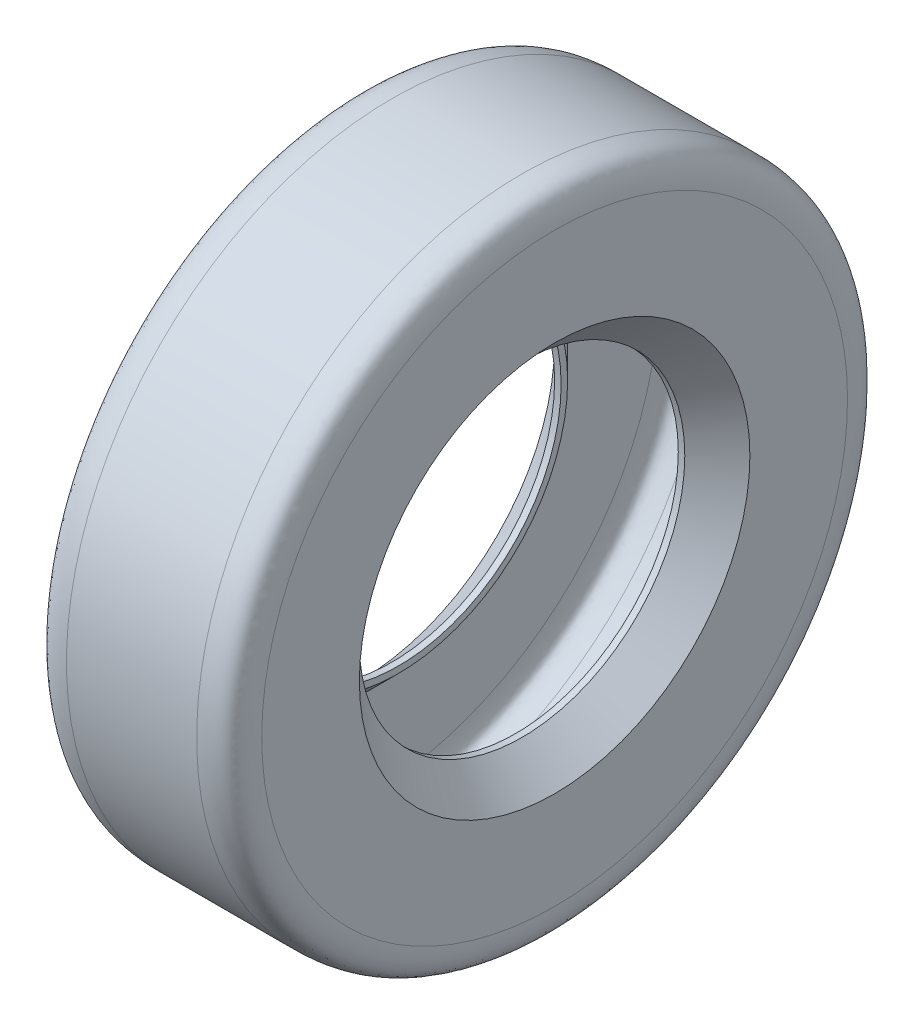
ISO-10303-21;
HEADER;
FILE_DESCRIPTION(('STEP AP214'),'2;1');
FILE_NAME('part.step','',(''),(''),'','','');
FILE_SCHEMA(('AUTOMOTIVE_DESIGN { 1 0 10303 214 1 1 1 1 }'));
ENDSEC;
DATA;
#1=APPLICATION_CONTEXT('core data for automotive mechanical design processes');
#2=APPLICATION_PROTOCOL_DEFINITION('international standard','automotive_design',2000,#1);
#3=PRODUCT_CONTEXT('',#1,'mechanical');
#4=PRODUCT('Part','Part','',(#3));
#5=PRODUCT_RELATED_PRODUCT_CATEGORY('part','',(#4));
#6=PRODUCT_DEFINITION_FORMATION('','',#4);
#7=PRODUCT_DEFINITION_CONTEXT('part definition',#1,'design');
#8=PRODUCT_DEFINITION('design','',#6,#7);
#9=PRODUCT_DEFINITION_SHAPE('','',#8);
#10=(LENGTH_UNIT() NAMED_UNIT(*) SI_UNIT(.MILLI.,.METRE.));
#11=(NAMED_UNIT(*) PLANE_ANGLE_UNIT() SI_UNIT($,.RADIAN.));
#12=(NAMED_UNIT(*) SI_UNIT($,.STERADIAN.) SOLID_ANGLE_UNIT());
#13=UNCERTAINTY_MEASURE_WITH_UNIT(LENGTH_MEASURE(1.E-05),#10,'distance_accuracy_value','');
#14=(GEOMETRIC_REPRESENTATION_CONTEXT(3) GLOBAL_UNCERTAINTY_ASSIGNED_CONTEXT((#13)) GLOBAL_UNIT_ASSIGNED_CONTEXT((#10,
#11,#12)) REPRESENTATION_CONTEXT('',''));
#15=CARTESIAN_POINT('',(0.,0.,0.));
#16=DIRECTION('',(0.,0.,1.));
#17=DIRECTION('',(1.,0.,0.));
#18=AXIS2_PLACEMENT_3D('',#15,#16,#17);
#19=CARTESIAN_POINT('',(0.,0.,0.));
#20=DIRECTION('',(1.,0.,0.));
#21=DIRECTION('',(0.,0.,-1.));
#22=AXIS2_PLACEMENT_3D('',#19,#20,#21);
#23=CYLINDRICAL_SURFACE('',#22,63.5);
#24=CARTESIAN_POINT('',(25.4,0.,0.));
#25=DIRECTION('',(1.,0.,0.));
#26=DIRECTION('',(0.,0.,-1.));
#27=AXIS2_PLACEMENT_3D('',#24,#25,#26);
#28=CIRCLE('',#27,63.5);
#29=CARTESIAN_POINT('',(25.4,0.,-63.5));
#30=VERTEX_POINT('',#29);
#31=EDGE_CURVE('E89',#30,#30,#28,.T.);
#32=ORIENTED_EDGE('',*,*,#31,.T.);
#33=EDGE_LOOP('',(#32));
#34=FACE_BOUND('',#33,.T.);
#35=CARTESIAN_POINT('',(22.86,0.,0.));
#36=DIRECTION('',(1.,0.,0.));
#37=DIRECTION('',(0.,0.,-1.));
#38=AXIS2_PLACEMENT_3D('',#35,#36,#37);
#39=CIRCLE('',#38,63.5);
#40=CARTESIAN_POINT('',(22.86,0.,-63.5));
#41=VERTEX_POINT('',#40);
#42=EDGE_CURVE('E10',#41,#41,#39,.T.);
#43=ORIENTED_EDGE('',*,*,#42,.F.);
#44=EDGE_LOOP('',(#43));
#45=FACE_BOUND('',#44,.T.);
#46=ADVANCED_FACE('F31',(#34,#45),#23,.F.);
#47=CARTESIAN_POINT('',(22.86,66.04,0.));
#48=DIRECTION('',(-1.,0.,0.));
#49=DIRECTION('',(0.,0.,1.));
#50=AXIS2_PLACEMENT_3D('',#47,#48,#49);
#51=PLANE('',#50);
#52=ORIENTED_EDGE('',*,*,#42,.T.);
#53=EDGE_LOOP('',(#52));
#54=FACE_BOUND('',#53,.T.);
#55=CARTESIAN_POINT('',(22.86,0.,0.));
#56=DIRECTION('',(1.,0.,0.));
#57=DIRECTION('',(0.,0.,-1.));
#58=AXIS2_PLACEMENT_3D('',#55,#56,#57);
#59=CIRCLE('',#58,66.04);
#60=CARTESIAN_POINT('',(22.86,0.,-66.04));
#61=VERTEX_POINT('',#60);
#62=EDGE_CURVE('E37',#61,#61,#59,.T.);
#63=ORIENTED_EDGE('',*,*,#62,.F.);
#64=EDGE_LOOP('',(#63));
#65=FACE_BOUND('',#64,.T.);
#66=ADVANCED_FACE('F117',(#54,#65),#51,.T.);
#67=CARTESIAN_POINT('',(35.56,0.,0.));
#68=DIRECTION('',(1.,0.,0.));
#69=DIRECTION('',(0.,0.,-1.));
#70=AXIS2_PLACEMENT_3D('',#67,#68,#69);
#71=CONICAL_SURFACE('',#70,78.74,0.785398163397449);
#72=ORIENTED_EDGE('',*,*,#62,.T.);
#73=EDGE_LOOP('',(#72));
#74=FACE_BOUND('',#73,.T.);
#75=CARTESIAN_POINT('',(35.56,0.,0.));
#76=DIRECTION('',(1.,0.,0.));
#77=DIRECTION('',(0.,0.,-1.));
#78=AXIS2_PLACEMENT_3D('',#75,#76,#77);
#79=CIRCLE('',#78,78.74);
#80=CARTESIAN_POINT('',(35.56,0.,-78.74));
#81=VERTEX_POINT('',#80);
#82=EDGE_CURVE('E41',#81,#81,#79,.T.);
#83=ORIENTED_EDGE('',*,*,#82,.F.);
#84=EDGE_LOOP('',(#83));
#85=FACE_BOUND('',#84,.T.);
#86=ADVANCED_FACE('F114',(#74,#85),#71,.T.);
#87=CARTESIAN_POINT('',(35.56,78.74,0.));
#88=DIRECTION('',(-1.,0.,0.));
#89=DIRECTION('',(0.,0.,1.));
#90=AXIS2_PLACEMENT_3D('',#87,#88,#89);
#91=PLANE('',#90);
#92=ORIENTED_EDGE('',*,*,#82,.T.);
#93=EDGE_LOOP('',(#92));
#94=FACE_BOUND('',#93,.T.);
#95=CARTESIAN_POINT('',(35.56,0.,0.));
#96=DIRECTION('',(1.,0.,0.));
#97=DIRECTION('',(0.,0.,-1.));
#98=AXIS2_PLACEMENT_3D('',#95,#96,#97);
#99=CIRCLE('',#98,114.3);
#100=CARTESIAN_POINT('',(35.56,0.,-114.3));
#101=VERTEX_POINT('',#100);
#102=EDGE_CURVE('E45',#101,#101,#99,.T.);
#103=ORIENTED_EDGE('',*,*,#102,.F.);
#104=EDGE_LOOP('',(#103));
#105=FACE_BOUND('',#104,.T.);
#106=ADVANCED_FACE('F109',(#94,#105),#91,.T.);
#107=CARTESIAN_POINT('',(25.4,124.46,0.));
#108=CARTESIAN_POINT('',(25.805832113396,124.46,0.));
#109=CARTESIAN_POINT('',(26.605403528514,124.460196460358,0.));
#110=CARTESIAN_POINT('',(28.3012248589449,124.423710763719,0.));
#111=CARTESIAN_POINT('',(30.4170550067174,124.242459368176,0.));
#112=CARTESIAN_POINT('',(32.2004204589752,123.750562190293,0.));
#113=CARTESIAN_POINT('',(33.2340314195877,123.186604386032,0.));
#114=CARTESIAN_POINT('',(33.8075713292461,122.705830521384,0.));
#115=CARTESIAN_POINT('',(34.2493325661398,122.117984468043,0.));
#116=CARTESIAN_POINT('',(34.691360923176,121.193385658606,0.));
#117=CARTESIAN_POINT('',(35.0400017191156,120.054632817678,0.));
#118=CARTESIAN_POINT('',(35.2911342849393,118.787688940268,0.));
#119=CARTESIAN_POINT('',(35.4485013209214,117.490904625784,0.));
#120=CARTESIAN_POINT('',(35.5304238452179,116.249768154165,0.));
#121=CARTESIAN_POINT('',(35.5545290754917,115.335705853149,0.));
#122=CARTESIAN_POINT('',(35.5598481338527,114.699197969848,0.));
#123=CARTESIAN_POINT('',(35.56,114.437804616846,0.));
#124=CARTESIAN_POINT('',(35.56,114.3,0.));
#125=B_SPLINE_CURVE_WITH_KNOTS('',3,(#107,#108,#109,#110,#111,#112,#113,#114,#115,#116,#117,
#118,#119,#120,#121,#122,#123,#124),.UNSPECIFIED.,.F.,.F.,(4,1,1,1,1,1,1,1,1,1,1,1,1,1,1,4),(0.,
0.0625,0.125,0.25,0.375,0.4375,0.5,0.5625,0.625,0.6875,0.75,0.8125,0.875,0.9375,0.96875,1.),.UNSPECIFIED.);
#126=CARTESIAN_POINT('',(0.,0.,0.));
#127=DIRECTION('',(1.,0.,0.));
#128=AXIS1_PLACEMENT('',#126,#127);
#129=SURFACE_OF_REVOLUTION('',#125,#128);
#130=ORIENTED_EDGE('',*,*,#102,.T.);
#131=EDGE_LOOP('',(#130));
#132=FACE_BOUND('',#131,.T.);
#133=CARTESIAN_POINT('',(25.4,0.,0.));
#134=DIRECTION('',(1.,0.,0.));
#135=DIRECTION('',(0.,0.,-1.));
#136=AXIS2_PLACEMENT_3D('',#133,#134,#135);
#137=CIRCLE('',#136,124.46);
#138=CARTESIAN_POINT('',(25.4,0.,-124.46));
#139=VERTEX_POINT('',#138);
#140=EDGE_CURVE('E50',#139,#139,#137,.T.);
#141=ORIENTED_EDGE('',*,*,#140,.F.);
#142=EDGE_LOOP('',(#141));
#143=FACE_BOUND('',#142,.T.);
#144=ADVANCED_FACE('F104',(#132,#143),#129,.F.);
#145=CARTESIAN_POINT('',(0.,0.,0.));
#146=DIRECTION('',(1.,0.,0.));
#147=DIRECTION('',(0.,0.,-1.));
#148=AXIS2_PLACEMENT_3D('',#145,#146,#147);
#149=CYLINDRICAL_SURFACE('',#148,124.46);
#150=ORIENTED_EDGE('',*,*,#140,.T.);
#151=EDGE_LOOP('',(#150));
#152=FACE_BOUND('',#151,.T.);
#153=CARTESIAN_POINT('',(-25.4,0.,0.));
#154=DIRECTION('',(1.,0.,0.));
#155=DIRECTION('',(0.,0.,-1.));
#156=AXIS2_PLACEMENT_3D('',#153,#154,#155);
#157=CIRCLE('',#156,124.46);
#158=CARTESIAN_POINT('',(-25.4,0.,-124.46));
#159=VERTEX_POINT('',#158);
#160=EDGE_CURVE('E53',#159,#159,#157,.T.);
#161=ORIENTED_EDGE('',*,*,#160,.F.);
#162=EDGE_LOOP('',(#161));
#163=FACE_BOUND('',#162,.T.);
#164=ADVANCED_FACE('F108',(#152,#163),#149,.F.);
#165=CARTESIAN_POINT('',(-35.56,114.3,0.));
#166=CARTESIAN_POINT('',(-35.56,114.437804616846,0.));
#167=CARTESIAN_POINT('',(-35.5598481338527,114.699197969848,0.));
#168=CARTESIAN_POINT('',(-35.5545290754917,115.335705853149,0.));
#169=CARTESIAN_POINT('',(-35.5304238452179,116.249768154165,0.));
#170=CARTESIAN_POINT('',(-35.4485013209214,117.490904625784,0.));
#171=CARTESIAN_POINT('',(-35.2911342849393,118.787688940268,0.));
#172=CARTESIAN_POINT('',(-35.0400017191156,120.054632817678,0.));
#173=CARTESIAN_POINT('',(-34.691360923176,121.193385658606,0.));
#174=CARTESIAN_POINT('',(-34.2493325661398,122.117984468043,0.));
#175=CARTESIAN_POINT('',(-33.8075713292461,122.705830521384,0.));
#176=CARTESIAN_POINT('',(-33.2340314195877,123.186604386032,0.));
#177=CARTESIAN_POINT('',(-32.2004204589752,123.750562190293,0.));
#178=CARTESIAN_POINT('',(-30.4170550067174,124.242459368176,0.));
#179=CARTESIAN_POINT('',(-28.3012248589449,124.423710763719,0.));
#180=CARTESIAN_POINT('',(-26.605403528514,124.460196460358,0.));
#181=CARTESIAN_POINT('',(-25.805832113396,124.46,0.));
#182=CARTESIAN_POINT('',(-25.4,124.46,0.));
#183=B_SPLINE_CURVE_WITH_KNOTS('',3,(#165,#166,#167,#168,#169,#170,#171,#172,#173,#174,#175,
#176,#177,#178,#179,#180,#181,#182),.UNSPECIFIED.,.F.,.F.,(4,1,1,1,1,1,1,1,1,1,1,1,1,1,1,4),(0.,
0.03125,0.0625,0.125,0.1875,0.25,0.3125,0.375,0.4375,0.5,0.5625,0.625,0.75,0.875,0.9375,1.),.UNSPECIFIED.);
#184=CARTESIAN_POINT('',(0.,0.,0.));
#185=DIRECTION('',(1.,0.,0.));
#186=AXIS1_PLACEMENT('',#184,#185);
#187=SURFACE_OF_REVOLUTION('',#183,#186);
#188=ORIENTED_EDGE('',*,*,#160,.T.);
#189=EDGE_LOOP('',(#188));
#190=FACE_BOUND('',#189,.T.);
#191=CARTESIAN_POINT('',(-35.56,0.,0.));
#192=DIRECTION('',(1.,0.,0.));
#193=DIRECTION('',(0.,0.,-1.));
#194=AXIS2_PLACEMENT_3D('',#191,#192,#193);
#195=CIRCLE('',#194,114.3);
#196=CARTESIAN_POINT('',(-35.56,0.,-114.3));
#197=VERTEX_POINT('',#196);
#198=EDGE_CURVE('E56',#197,#197,#195,.T.);
#199=ORIENTED_EDGE('',*,*,#198,.F.);
#200=EDGE_LOOP('',(#199));
#201=FACE_BOUND('',#200,.T.);
#202=ADVANCED_FACE('F185',(#190,#201),#187,.F.);
#203=CARTESIAN_POINT('',(-35.56,78.74,0.));
#204=DIRECTION('',(1.,0.,0.));
#205=DIRECTION('',(0.,0.,-1.));
#206=AXIS2_PLACEMENT_3D('',#203,#204,#205);
#207=PLANE('',#206);
#208=ORIENTED_EDGE('',*,*,#198,.T.);
#209=EDGE_LOOP('',(#208));
#210=FACE_BOUND('',#209,.T.);
#211=CARTESIAN_POINT('',(-35.56,0.,0.));
#212=DIRECTION('',(1.,0.,0.));
#213=DIRECTION('',(0.,0.,-1.));
#214=AXIS2_PLACEMENT_3D('',#211,#212,#213);
#215=CIRCLE('',#214,78.74);
#216=CARTESIAN_POINT('',(-35.56,0.,-78.74));
#217=VERTEX_POINT('',#216);
#218=EDGE_CURVE('E59',#217,#217,#215,.T.);
#219=ORIENTED_EDGE('',*,*,#218,.F.);
#220=EDGE_LOOP('',(#219));
#221=FACE_BOUND('',#220,.T.);
#222=ADVANCED_FACE('F182',(#210,#221),#207,.T.);
#223=CARTESIAN_POINT('',(-22.86,0.,0.));
#224=DIRECTION('',(-1.,0.,0.));
#225=DIRECTION('',(0.,0.,1.));
#226=AXIS2_PLACEMENT_3D('',#223,#224,#225);
#227=CONICAL_SURFACE('',#226,66.04,0.785398163397449);
#228=ORIENTED_EDGE('',*,*,#218,.T.);
#229=EDGE_LOOP('',(#228));
#230=FACE_BOUND('',#229,.T.);
#231=CARTESIAN_POINT('',(-22.86,0.,0.));
#232=DIRECTION('',(1.,0.,0.));
#233=DIRECTION('',(0.,0.,-1.));
#234=AXIS2_PLACEMENT_3D('',#231,#232,#233);
#235=CIRCLE('',#234,66.04);
#236=CARTESIAN_POINT('',(-22.86,0.,-66.04));
#237=VERTEX_POINT('',#236);
#238=EDGE_CURVE('E62',#237,#237,#235,.T.);
#239=ORIENTED_EDGE('',*,*,#238,.F.);
#240=EDGE_LOOP('',(#239));
#241=FACE_BOUND('',#240,.T.);
#242=ADVANCED_FACE('F178',(#230,#241),#227,.T.);
#243=CARTESIAN_POINT('',(-22.86,66.04,0.));
#244=DIRECTION('',(1.,0.,0.));
#245=DIRECTION('',(0.,0.,-1.));
#246=AXIS2_PLACEMENT_3D('',#243,#244,#245);
#247=PLANE('',#246);
#248=ORIENTED_EDGE('',*,*,#238,.T.);
#249=EDGE_LOOP('',(#248));
#250=FACE_BOUND('',#249,.T.);
#251=CARTESIAN_POINT('',(-22.86,0.,0.));
#252=DIRECTION('',(1.,0.,0.));
#253=DIRECTION('',(0.,0.,-1.));
#254=AXIS2_PLACEMENT_3D('',#251,#252,#253);
#255=CIRCLE('',#254,63.5);
#256=CARTESIAN_POINT('',(-22.86,0.,-63.5));
#257=VERTEX_POINT('',#256);
#258=EDGE_CURVE('E65',#257,#257,#255,.T.);
#259=ORIENTED_EDGE('',*,*,#258,.F.);
#260=EDGE_LOOP('',(#259));
#261=FACE_BOUND('',#260,.T.);
#262=ADVANCED_FACE('F174',(#250,#261),#247,.T.);
#263=CARTESIAN_POINT('',(0.,0.,0.));
#264=DIRECTION('',(1.,0.,0.));
#265=DIRECTION('',(0.,0.,-1.));
#266=AXIS2_PLACEMENT_3D('',#263,#264,#265);
#267=CYLINDRICAL_SURFACE('',#266,63.5);
#268=ORIENTED_EDGE('',*,*,#258,.T.);
#269=EDGE_LOOP('',(#268));
#270=FACE_BOUND('',#269,.T.);
#271=CARTESIAN_POINT('',(-25.4,0.,0.));
#272=DIRECTION('',(1.,0.,0.));
#273=DIRECTION('',(0.,0.,-1.));
#274=AXIS2_PLACEMENT_3D('',#271,#272,#273);
#275=CIRCLE('',#274,63.5);
#276=CARTESIAN_POINT('',(-25.4,0.,-63.5));
#277=VERTEX_POINT('',#276);
#278=EDGE_CURVE('E68',#277,#277,#275,.T.);
#279=ORIENTED_EDGE('',*,*,#278,.F.);
#280=EDGE_LOOP('',(#279));
#281=FACE_BOUND('',#280,.T.);
#282=ADVANCED_FACE('F170',(#270,#281),#267,.F.);
#283=CARTESIAN_POINT('',(-38.1,0.,0.));
#284=DIRECTION('',(-1.,0.,0.));
#285=DIRECTION('',(0.,0.,1.));
#286=AXIS2_PLACEMENT_3D('',#283,#284,#285);
#287=CONICAL_SURFACE('',#286,76.2,0.785398163397449);
#288=ORIENTED_EDGE('',*,*,#278,.T.);
#289=EDGE_LOOP('',(#288));
#290=FACE_BOUND('',#289,.T.);
#291=CARTESIAN_POINT('',(-38.1,0.,0.));
#292=DIRECTION('',(1.,0.,0.));
#293=DIRECTION('',(0.,0.,-1.));
#294=AXIS2_PLACEMENT_3D('',#291,#292,#293);
#295=CIRCLE('',#294,76.2);
#296=CARTESIAN_POINT('',(-38.1,0.,-76.2));
#297=VERTEX_POINT('',#296);
#298=EDGE_CURVE('E71',#297,#297,#295,.T.);
#299=ORIENTED_EDGE('',*,*,#298,.F.);
#300=EDGE_LOOP('',(#299));
#301=FACE_BOUND('',#300,.T.);
#302=ADVANCED_FACE('F166',(#290,#301),#287,.F.);
#303=CARTESIAN_POINT('',(-38.1,76.2,0.));
#304=DIRECTION('',(-1.,0.,0.));
#305=DIRECTION('',(0.,0.,1.));
#306=AXIS2_PLACEMENT_3D('',#303,#304,#305);
#307=PLANE('',#306);
#308=ORIENTED_EDGE('',*,*,#298,.T.);
#309=EDGE_LOOP('',(#308));
#310=FACE_BOUND('',#309,.T.);
#311=CARTESIAN_POINT('',(-38.1,0.,0.));
#312=DIRECTION('',(1.,0.,0.));
#313=DIRECTION('',(0.,0.,-1.));
#314=AXIS2_PLACEMENT_3D('',#311,#312,#313);
#315=CIRCLE('',#314,114.3);
#316=CARTESIAN_POINT('',(-38.1,0.,-114.3));
#317=VERTEX_POINT('',#316);
#318=EDGE_CURVE('E74',#317,#317,#315,.T.);
#319=ORIENTED_EDGE('',*,*,#318,.F.);
#320=EDGE_LOOP('',(#319));
#321=FACE_BOUND('',#320,.T.);
#322=ADVANCED_FACE('F162',(#310,#321),#307,.T.);
#323=CARTESIAN_POINT('',(-25.4,127.,0.));
#324=CARTESIAN_POINT('',(-28.68636896419,127.,0.));
#325=CARTESIAN_POINT('',(-38.0644233163514,127.022398822885,0.));
#326=CARTESIAN_POINT('',(-38.1,116.276431222136,0.));
#327=CARTESIAN_POINT('',(-38.1,114.3,0.));
#328=B_SPLINE_CURVE_WITH_KNOTS('',3,(#323,#324,#325,#326,#327),.UNSPECIFIED.,.F.,.F.,(4,1,4),
(0.,0.520719284337781,1.),.UNSPECIFIED.);
#329=CARTESIAN_POINT('',(0.,0.,0.));
#330=DIRECTION('',(1.,0.,0.));
#331=AXIS1_PLACEMENT('',#329,#330);
#332=SURFACE_OF_REVOLUTION('',#328,#331);
#333=ORIENTED_EDGE('',*,*,#318,.T.);
#334=EDGE_LOOP('',(#333));
#335=FACE_BOUND('',#334,.T.);
#336=CARTESIAN_POINT('',(-25.4,0.,0.));
#337=DIRECTION('',(1.,0.,0.));
#338=DIRECTION('',(0.,0.,-1.));
#339=AXIS2_PLACEMENT_3D('',#336,#337,#338);
#340=CIRCLE('',#339,127.);
#341=CARTESIAN_POINT('',(-25.4,0.,-127.));
#342=VERTEX_POINT('',#341);
#343=EDGE_CURVE('E77',#342,#342,#340,.T.);
#344=ORIENTED_EDGE('',*,*,#343,.F.);
#345=EDGE_LOOP('',(#344));
#346=FACE_BOUND('',#345,.T.);
#347=ADVANCED_FACE('F159',(#335,#346),#332,.F.);
#348=CARTESIAN_POINT('',(0.,0.,0.));
#349=DIRECTION('',(1.,0.,0.));
#350=DIRECTION('',(0.,0.,-1.));
#351=AXIS2_PLACEMENT_3D('',#348,#349,#350);
#352=CYLINDRICAL_SURFACE('',#351,127.);
#353=ORIENTED_EDGE('',*,*,#343,.T.);
#354=EDGE_LOOP('',(#353));
#355=FACE_BOUND('',#354,.T.);
#356=CARTESIAN_POINT('',(25.4,0.,0.));
#357=DIRECTION('',(1.,0.,0.));
#358=DIRECTION('',(0.,0.,-1.));
#359=AXIS2_PLACEMENT_3D('',#356,#357,#358);
#360=CIRCLE('',#359,127.);
#361=CARTESIAN_POINT('',(25.4,0.,-127.));
#362=VERTEX_POINT('',#361);
#363=EDGE_CURVE('E80',#362,#362,#360,.T.);
#364=ORIENTED_EDGE('',*,*,#363,.F.);
#365=EDGE_LOOP('',(#364));
#366=FACE_BOUND('',#365,.T.);
#367=ADVANCED_FACE('F144',(#355,#366),#352,.T.);
#368=CARTESIAN_POINT('',(38.1,114.3,0.));
#369=CARTESIAN_POINT('',(38.1,116.276431222136,0.));
#370=CARTESIAN_POINT('',(38.0644233163514,127.022398822885,0.));
#371=CARTESIAN_POINT('',(28.68636896419,127.,0.));
#372=CARTESIAN_POINT('',(25.4,127.,0.));
#373=B_SPLINE_CURVE_WITH_KNOTS('',3,(#368,#369,#370,#371,#372),.UNSPECIFIED.,.F.,.F.,(4,1,4),
(0.,0.479280715662219,1.),.UNSPECIFIED.);
#374=CARTESIAN_POINT('',(0.,0.,0.));
#375=DIRECTION('',(1.,0.,0.));
#376=AXIS1_PLACEMENT('',#374,#375);
#377=SURFACE_OF_REVOLUTION('',#373,#376);
#378=ORIENTED_EDGE('',*,*,#363,.T.);
#379=EDGE_LOOP('',(#378));
#380=FACE_BOUND('',#379,.T.);
#381=CARTESIAN_POINT('',(38.1,0.,0.));
#382=DIRECTION('',(1.,0.,0.));
#383=DIRECTION('',(0.,0.,-1.));
#384=AXIS2_PLACEMENT_3D('',#381,#382,#383);
#385=CIRCLE('',#384,114.3);
#386=CARTESIAN_POINT('',(38.1,0.,-114.3));
#387=VERTEX_POINT('',#386);
#388=EDGE_CURVE('E83',#387,#387,#385,.T.);
#389=ORIENTED_EDGE('',*,*,#388,.F.);
#390=EDGE_LOOP('',(#389));
#391=FACE_BOUND('',#390,.T.);
#392=ADVANCED_FACE('F137',(#380,#391),#377,.F.);
#393=CARTESIAN_POINT('',(38.1,76.2,0.));
#394=DIRECTION('',(1.,0.,0.));
#395=DIRECTION('',(0.,0.,-1.));
#396=AXIS2_PLACEMENT_3D('',#393,#394,#395);
#397=PLANE('',#396);
#398=ORIENTED_EDGE('',*,*,#388,.T.);
#399=EDGE_LOOP('',(#398));
#400=FACE_BOUND('',#399,.T.);
#401=CARTESIAN_POINT('',(38.1,0.,0.));
#402=DIRECTION('',(1.,0.,0.));
#403=DIRECTION('',(0.,0.,-1.));
#404=AXIS2_PLACEMENT_3D('',#401,#402,#403);
#405=CIRCLE('',#404,76.2);
#406=CARTESIAN_POINT('',(38.1,0.,-76.2));
#407=VERTEX_POINT('',#406);
#408=EDGE_CURVE('E86',#407,#407,#405,.T.);
#409=ORIENTED_EDGE('',*,*,#408,.F.);
#410=EDGE_LOOP('',(#409));
#411=FACE_BOUND('',#410,.T.);
#412=ADVANCED_FACE('F131',(#400,#411),#397,.T.);
#413=CARTESIAN_POINT('',(25.4,0.,0.));
#414=DIRECTION('',(1.,0.,0.));
#415=DIRECTION('',(0.,0.,-1.));
#416=AXIS2_PLACEMENT_3D('',#413,#414,#415);
#417=CONICAL_SURFACE('',#416,63.5,0.785398163397449);
#418=ORIENTED_EDGE('',*,*,#408,.T.);
#419=EDGE_LOOP('',(#418));
#420=FACE_BOUND('',#419,.T.);
#421=ORIENTED_EDGE('',*,*,#31,.F.);
#422=EDGE_LOOP('',(#421));
#423=FACE_BOUND('',#422,.T.);
#424=ADVANCED_FACE('F129',(#420,#423),#417,.F.);
#425=CLOSED_SHELL('',(#46,#66,#86,#106,#144,#164,#202,#222,#242,#262,#282,#302,#322,#347,#367,
#392,#412,#424));
#426=MANIFOLD_SOLID_BREP('B2',#425);
#427=ADVANCED_BREP_SHAPE_REPRESENTATION('',(#18,#426),#14);
#428=SHAPE_DEFINITION_REPRESENTATION(#9,#427);
ENDSEC;
END-ISO-10303-21;
